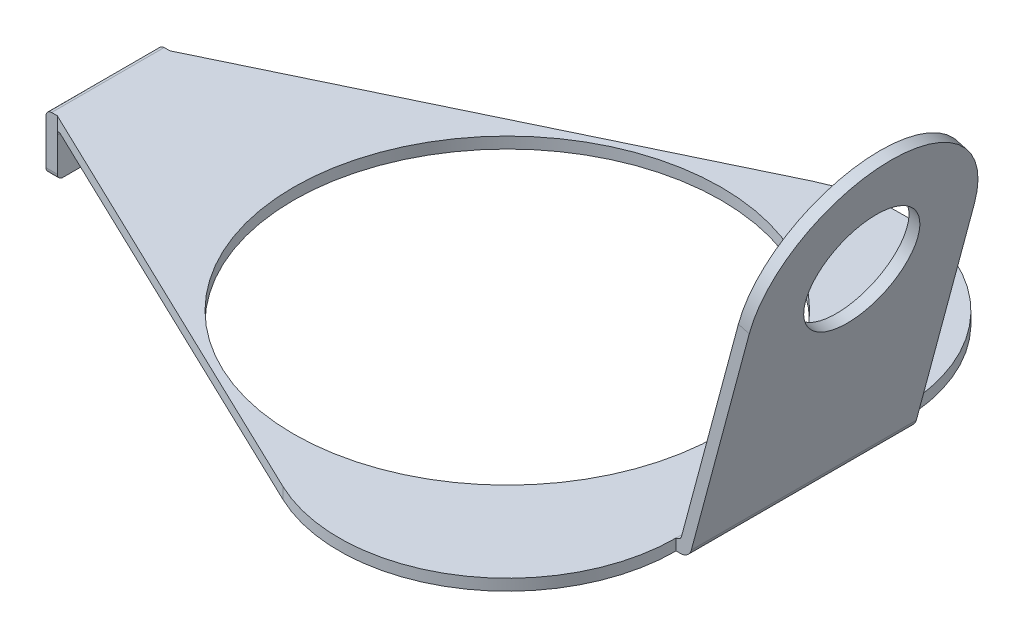
ISO-10303-21;
HEADER;
FILE_DESCRIPTION(('STEP AP214'),'2;1');
FILE_NAME('part.step','',(''),(''),'','','');
FILE_SCHEMA(('AUTOMOTIVE_DESIGN { 1 0 10303 214 1 1 1 1 }'));
ENDSEC;
DATA;
#1=APPLICATION_CONTEXT('core data for automotive mechanical design processes');
#2=APPLICATION_PROTOCOL_DEFINITION('international standard','automotive_design',2000,#1);
#3=PRODUCT_CONTEXT('',#1,'mechanical');
#4=PRODUCT('Part','Part','',(#3));
#5=PRODUCT_RELATED_PRODUCT_CATEGORY('part','',(#4));
#6=PRODUCT_DEFINITION_FORMATION('','',#4);
#7=PRODUCT_DEFINITION_CONTEXT('part definition',#1,'design');
#8=PRODUCT_DEFINITION('design','',#6,#7);
#9=PRODUCT_DEFINITION_SHAPE('','',#8);
#10=(LENGTH_UNIT() NAMED_UNIT(*) SI_UNIT(.MILLI.,.METRE.));
#11=(NAMED_UNIT(*) PLANE_ANGLE_UNIT() SI_UNIT($,.RADIAN.));
#12=(NAMED_UNIT(*) SI_UNIT($,.STERADIAN.) SOLID_ANGLE_UNIT());
#13=UNCERTAINTY_MEASURE_WITH_UNIT(LENGTH_MEASURE(1.E-05),#10,'distance_accuracy_value','');
#14=(GEOMETRIC_REPRESENTATION_CONTEXT(3) GLOBAL_UNCERTAINTY_ASSIGNED_CONTEXT((#13)) GLOBAL_UNIT_ASSIGNED_CONTEXT((#10,
#11,#12)) REPRESENTATION_CONTEXT('',''));
#15=CARTESIAN_POINT('',(0.,0.,0.));
#16=DIRECTION('',(0.,0.,1.));
#17=DIRECTION('',(1.,0.,0.));
#18=AXIS2_PLACEMENT_3D('',#15,#16,#17);
#19=CARTESIAN_POINT('',(8.65846886349737,7.52425212699832,-2.54));
#20=DIRECTION('',(0.965925826289067,-0.258819045102524,0.));
#21=DIRECTION('',(0.258819045102524,0.965925826289067,0.));
#22=AXIS2_PLACEMENT_3D('',#19,#20,#21);
#23=PLANE('',#22);
#24=CARTESIAN_POINT('',(8.00106848893696,5.07080052822409,0.));
#25=DIRECTION('',(0.965925826289067,-0.258819045102525,0.));
#26=DIRECTION('',(0.258819045102525,0.965925826289067,0.));
#27=AXIS2_PLACEMENT_3D('',#24,#25,#26);
#28=CIRCLE('',#27,2.54);
#29=CARTESIAN_POINT('',(8.00106848893697,5.07080052822409,2.54));
#30=VERTEX_POINT('',#29);
#31=CARTESIAN_POINT('',(8.00106848893696,5.07080052822409,-2.54));
#32=VERTEX_POINT('',#31);
#33=EDGE_CURVE('E196',#30,#32,#28,.F.);
#34=ORIENTED_EDGE('',*,*,#33,.F.);
#35=DIRECTION('',(0.258819045102525,0.965925826289067,0.));
#36=VECTOR('',#35,1.);
#37=CARTESIAN_POINT('',(6.69279568735075,0.188259962543961,2.54));
#38=LINE('',#37,#36);
#39=CARTESIAN_POINT('',(6.69279568735075,0.18825996254396,2.54));
#40=VERTEX_POINT('',#39);
#41=EDGE_CURVE('E171',#40,#30,#38,.T.);
#42=ORIENTED_EDGE('',*,*,#41,.F.);
#43=DIRECTION('',(0.,0.,1.));
#44=VECTOR('',#43,1.);
#45=CARTESIAN_POINT('',(6.69279568735075,0.188259962543961,-2.54));
#46=LINE('',#45,#44);
#47=CARTESIAN_POINT('',(6.69279568735075,0.18825996254396,-2.54));
#48=VERTEX_POINT('',#47);
#49=EDGE_CURVE('E202',#48,#40,#46,.T.);
#50=ORIENTED_EDGE('',*,*,#49,.F.);
#51=DIRECTION('',(0.258819045102525,0.965925826289067,0.));
#52=VECTOR('',#51,1.);
#53=CARTESIAN_POINT('',(6.69279568735075,0.188259962543961,-2.54));
#54=LINE('',#53,#52);
#55=EDGE_CURVE('E177',#48,#32,#54,.T.);
#56=ORIENTED_EDGE('',*,*,#55,.T.);
#57=EDGE_LOOP('',(#34,#42,#50,#56));
#58=FACE_BOUND('',#57,.T.);
#59=CARTESIAN_POINT('',(8.00106848893697,5.07080052822409,0.));
#60=DIRECTION('',(0.965925826289067,-0.258819045102525,0.));
#61=DIRECTION('',(0.258819045102525,0.965925826289067,0.));
#62=AXIS2_PLACEMENT_3D('',#59,#60,#61);
#63=CIRCLE('',#62,1.27);
#64=CARTESIAN_POINT('',(8.32976867621718,6.2975263276112,0.));
#65=VERTEX_POINT('',#64);
#66=EDGE_CURVE('E256',#65,#65,#63,.F.);
#67=ORIENTED_EDGE('',*,*,#66,.T.);
#68=EDGE_LOOP('',(#67));
#69=FACE_BOUND('',#68,.T.);
#70=ADVANCED_FACE('F25',(#58,#69),#23,.T.);
#71=CARTESIAN_POINT('',(-8.89,-1.016,0.));
#72=DIRECTION('',(-1.,0.,0.));
#73=DIRECTION('',(0.,0.,1.));
#74=AXIS2_PLACEMENT_3D('',#71,#72,#73);
#75=PLANE('',#74);
#76=CARTESIAN_POINT('',(-8.89,-0.889,-1.143));
#77=DIRECTION('',(1.,0.,0.));
#78=DIRECTION('',(0.,0.,-1.));
#79=AXIS2_PLACEMENT_3D('',#76,#77,#78);
#80=CIRCLE('',#79,0.127);
#81=CARTESIAN_POINT('',(-8.89,-0.889,-1.27));
#82=VERTEX_POINT('',#81);
#83=CARTESIAN_POINT('',(-8.89,-1.016,-1.143));
#84=VERTEX_POINT('',#83);
#85=EDGE_CURVE('E200',#82,#84,#80,.F.);
#86=ORIENTED_EDGE('',*,*,#85,.F.);
#87=DIRECTION('',(0.,1.,0.));
#88=VECTOR('',#87,1.);
#89=CARTESIAN_POINT('',(-8.89,-1.016,-1.27));
#90=LINE('',#89,#88);
#91=CARTESIAN_POINT('',(-8.89,-0.127,-1.27));
#92=VERTEX_POINT('',#91);
#93=EDGE_CURVE('E197',#92,#82,#90,.F.);
#94=ORIENTED_EDGE('',*,*,#93,.F.);
#95=DIRECTION('',(0.,0.,1.));
#96=VECTOR('',#95,1.);
#97=CARTESIAN_POINT('',(-8.89,-0.127,0.));
#98=LINE('',#97,#96);
#99=CARTESIAN_POINT('',(-8.89,-0.127,1.27));
#100=VERTEX_POINT('',#99);
#101=EDGE_CURVE('E247',#92,#100,#98,.T.);
#102=ORIENTED_EDGE('',*,*,#101,.T.);
#103=DIRECTION('',(0.,1.,0.));
#104=VECTOR('',#103,1.);
#105=CARTESIAN_POINT('',(-8.89,-1.016,1.27));
#106=LINE('',#105,#104);
#107=CARTESIAN_POINT('',(-8.89,-0.889,1.27));
#108=VERTEX_POINT('',#107);
#109=EDGE_CURVE('E142',#108,#100,#106,.T.);
#110=ORIENTED_EDGE('',*,*,#109,.F.);
#111=CARTESIAN_POINT('',(-8.89,-0.889,1.143));
#112=DIRECTION('',(-1.,0.,0.));
#113=DIRECTION('',(0.,0.,1.));
#114=AXIS2_PLACEMENT_3D('',#111,#112,#113);
#115=CIRCLE('',#114,0.127);
#116=CARTESIAN_POINT('',(-8.89,-1.016,1.143));
#117=VERTEX_POINT('',#116);
#118=EDGE_CURVE('E28',#117,#108,#115,.T.);
#119=ORIENTED_EDGE('',*,*,#118,.F.);
#120=DIRECTION('',(0.,0.,1.));
#121=VECTOR('',#120,1.);
#122=CARTESIAN_POINT('',(-8.89,-1.016,0.));
#123=LINE('',#122,#121);
#124=EDGE_CURVE('E140',#117,#84,#123,.F.);
#125=ORIENTED_EDGE('',*,*,#124,.T.);
#126=EDGE_LOOP('',(#86,#94,#102,#110,#119,#125));
#127=FACE_BOUND('',#126,.T.);
#128=ADVANCED_FACE('F139',(#127),#75,.F.);
#129=CARTESIAN_POINT('',(-8.6252960951108,9.52582149158518,0.));
#130=DIRECTION('',(0.965925826289067,-0.258819045102525,0.));
#131=DIRECTION('',(0.258819045102525,0.965925826289067,0.));
#132=AXIS2_PLACEMENT_3D('',#129,#130,#131);
#133=CYLINDRICAL_SURFACE('',#132,1.27);
#134=CARTESIAN_POINT('',(7.75572332905955,5.13654056568013,0.));
#135=DIRECTION('',(0.965925826289067,-0.258819045102525,0.));
#136=DIRECTION('',(0.258819045102525,0.965925826289067,0.));
#137=AXIS2_PLACEMENT_3D('',#134,#135,#136);
#138=CIRCLE('',#137,1.27);
#139=CARTESIAN_POINT('',(8.08442351633975,6.36326636506725,0.));
#140=VERTEX_POINT('',#139);
#141=EDGE_CURVE('E239',#140,#140,#138,.T.);
#142=ORIENTED_EDGE('',*,*,#141,.F.);
#143=EDGE_LOOP('',(#142));
#144=FACE_BOUND('',#143,.T.);
#145=ORIENTED_EDGE('',*,*,#66,.F.);
#146=EDGE_LOOP('',(#145));
#147=FACE_BOUND('',#146,.T.);
#148=ADVANCED_FACE('F558',(#144,#147),#133,.F.);
#149=CARTESIAN_POINT('',(-8.6252960951108,9.52582149158518,0.));
#150=DIRECTION('',(0.965925826289067,-0.258819045102525,0.));
#151=DIRECTION('',(0.258819045102525,0.965925826289067,0.));
#152=AXIS2_PLACEMENT_3D('',#149,#150,#151);
#153=CYLINDRICAL_SURFACE('',#152,2.54);
#154=ORIENTED_EDGE('',*,*,#33,.T.);
#155=DIRECTION('',(-0.965925826289068,0.258819045102523,0.));
#156=VECTOR('',#155,1.);
#157=CARTESIAN_POINT('',(8.00106848893696,5.07080052822409,-2.54));
#158=LINE('',#157,#156);
#159=CARTESIAN_POINT('',(7.75572332905954,5.13654056568013,-2.54));
#160=VERTEX_POINT('',#159);
#161=EDGE_CURVE('E193',#32,#160,#158,.T.);
#162=ORIENTED_EDGE('',*,*,#161,.T.);
#163=CARTESIAN_POINT('',(7.75572332905955,5.13654056568013,0.));
#164=DIRECTION('',(0.965925826289067,-0.258819045102525,0.));
#165=DIRECTION('',(0.258819045102525,0.965925826289067,0.));
#166=AXIS2_PLACEMENT_3D('',#163,#164,#165);
#167=CIRCLE('',#166,2.54);
#168=CARTESIAN_POINT('',(7.75572332905954,5.13654056568013,2.54));
#169=VERTEX_POINT('',#168);
#170=EDGE_CURVE('E237',#169,#160,#167,.F.);
#171=ORIENTED_EDGE('',*,*,#170,.F.);
#172=DIRECTION('',(-0.965925826289068,0.258819045102522,0.));
#173=VECTOR('',#172,1.);
#174=CARTESIAN_POINT('',(8.00106848893696,5.07080052822409,2.54));
#175=LINE('',#174,#173);
#176=EDGE_CURVE('E174',#30,#169,#175,.T.);
#177=ORIENTED_EDGE('',*,*,#176,.F.);
#178=EDGE_LOOP('',(#154,#162,#171,#177));
#179=FACE_BOUND('',#178,.T.);
#180=ADVANCED_FACE('F376',(#179),#153,.T.);
#181=CARTESIAN_POINT('',(6.35,0.381,-2.54));
#182=DIRECTION('',(0.,0.,1.));
#183=DIRECTION('',(1.,0.,0.));
#184=AXIS2_PLACEMENT_3D('',#181,#182,#183);
#185=PLANE('',#184);
#186=CARTESIAN_POINT('',(6.44745052747333,0.254,-2.54));
#187=DIRECTION('',(0.,0.,1.));
#188=DIRECTION('',(1.,0.,0.));
#189=AXIS2_PLACEMENT_3D('',#186,#187,#188);
#190=CIRCLE('',#189,0.254);
#191=CARTESIAN_POINT('',(6.44745052747333,0.,-2.54));
#192=VERTEX_POINT('',#191);
#193=EDGE_CURVE('E205',#192,#48,#190,.T.);
#194=ORIENTED_EDGE('',*,*,#193,.F.);
#195=DIRECTION('',(1.,0.,0.));
#196=VECTOR('',#195,1.);
#197=CARTESIAN_POINT('',(6.35,0.,-2.54));
#198=LINE('',#197,#196);
#199=CARTESIAN_POINT('',(6.35,0.,-2.54));
#200=VERTEX_POINT('',#199);
#201=EDGE_CURVE('E187',#200,#192,#198,.T.);
#202=ORIENTED_EDGE('',*,*,#201,.F.);
#203=DIRECTION('',(0.,1.,0.));
#204=VECTOR('',#203,1.);
#205=CARTESIAN_POINT('',(6.35,0.381,-2.54));
#206=LINE('',#205,#204);
#207=CARTESIAN_POINT('',(6.35,0.254,-2.54));
#208=VERTEX_POINT('',#207);
#209=EDGE_CURVE('E189',#208,#200,#206,.F.);
#210=ORIENTED_EDGE('',*,*,#209,.F.);
#211=CARTESIAN_POINT('',(6.35,0.381,-2.54));
#212=DIRECTION('',(0.,0.,1.));
#213=DIRECTION('',(1.,0.,0.));
#214=AXIS2_PLACEMENT_3D('',#211,#212,#213);
#215=CIRCLE('',#214,0.127);
#216=CARTESIAN_POINT('',(6.47267257993871,0.348129981271979,-2.54));
#217=VERTEX_POINT('',#216);
#218=EDGE_CURVE('E192',#217,#208,#215,.F.);
#219=ORIENTED_EDGE('',*,*,#218,.F.);
#220=DIRECTION('',(-0.258819045102524,-0.965925826289067,0.));
#221=VECTOR('',#220,1.);
#222=CARTESIAN_POINT('',(6.47267257993871,0.348129981271979,-2.54));
#223=LINE('',#222,#221);
#224=EDGE_CURVE('E164',#160,#217,#223,.T.);
#225=ORIENTED_EDGE('',*,*,#224,.F.);
#226=ORIENTED_EDGE('',*,*,#161,.F.);
#227=ORIENTED_EDGE('',*,*,#55,.F.);
#228=EDGE_LOOP('',(#194,#202,#210,#219,#225,#226,#227));
#229=FACE_BOUND('',#228,.T.);
#230=ADVANCED_FACE('F387',(#229),#185,.F.);
#231=CARTESIAN_POINT('',(6.35,0.381,2.54));
#232=DIRECTION('',(0.,0.,1.));
#233=DIRECTION('',(1.,0.,0.));
#234=AXIS2_PLACEMENT_3D('',#231,#232,#233);
#235=PLANE('',#234);
#236=CARTESIAN_POINT('',(6.35,0.381,2.54));
#237=DIRECTION('',(0.,0.,1.));
#238=DIRECTION('',(1.,0.,0.));
#239=AXIS2_PLACEMENT_3D('',#236,#237,#238);
#240=CIRCLE('',#239,0.127);
#241=CARTESIAN_POINT('',(6.47267257993871,0.348129981271979,2.54));
#242=VERTEX_POINT('',#241);
#243=CARTESIAN_POINT('',(6.35,0.254,2.54));
#244=VERTEX_POINT('',#243);
#245=EDGE_CURVE('E170',#242,#244,#240,.F.);
#246=ORIENTED_EDGE('',*,*,#245,.T.);
#247=DIRECTION('',(0.,1.,0.));
#248=VECTOR('',#247,1.);
#249=CARTESIAN_POINT('',(6.35,0.381,2.54));
#250=LINE('',#249,#248);
#251=CARTESIAN_POINT('',(6.35,0.,2.54));
#252=VERTEX_POINT('',#251);
#253=EDGE_CURVE('E154',#244,#252,#250,.F.);
#254=ORIENTED_EDGE('',*,*,#253,.T.);
#255=DIRECTION('',(1.,0.,0.));
#256=VECTOR('',#255,1.);
#257=CARTESIAN_POINT('',(6.35,0.,2.54));
#258=LINE('',#257,#256);
#259=CARTESIAN_POINT('',(6.44745052747333,0.,2.54));
#260=VERTEX_POINT('',#259);
#261=EDGE_CURVE('E175',#252,#260,#258,.T.);
#262=ORIENTED_EDGE('',*,*,#261,.T.);
#263=CARTESIAN_POINT('',(6.44745052747333,0.254,2.54));
#264=DIRECTION('',(0.,0.,1.));
#265=DIRECTION('',(1.,0.,0.));
#266=AXIS2_PLACEMENT_3D('',#263,#264,#265);
#267=CIRCLE('',#266,0.254);
#268=EDGE_CURVE('E204',#40,#260,#267,.F.);
#269=ORIENTED_EDGE('',*,*,#268,.F.);
#270=ORIENTED_EDGE('',*,*,#41,.T.);
#271=ORIENTED_EDGE('',*,*,#176,.T.);
#272=DIRECTION('',(-0.258819045102524,-0.965925826289067,0.));
#273=VECTOR('',#272,1.);
#274=CARTESIAN_POINT('',(6.47267257993871,0.348129981271979,2.54));
#275=LINE('',#274,#273);
#276=EDGE_CURVE('E159',#242,#169,#275,.F.);
#277=ORIENTED_EDGE('',*,*,#276,.F.);
#278=EDGE_LOOP('',(#246,#254,#262,#269,#270,#271,#277));
#279=FACE_BOUND('',#278,.T.);
#280=ADVANCED_FACE('F365',(#279),#235,.T.);
#281=CARTESIAN_POINT('',(0.,-1.016,0.));
#282=DIRECTION('',(0.,1.,0.));
#283=DIRECTION('',(0.,0.,1.));
#284=AXIS2_PLACEMENT_3D('',#281,#282,#283);
#285=PLANE('',#284);
#286=DIRECTION('',(1.,0.,0.));
#287=VECTOR('',#286,1.);
#288=CARTESIAN_POINT('',(0.,-1.016,-1.143));
#289=LINE('',#288,#287);
#290=CARTESIAN_POINT('',(-9.144,-1.016,-1.143));
#291=VERTEX_POINT('',#290);
#292=EDGE_CURVE('E153',#84,#291,#289,.F.);
#293=ORIENTED_EDGE('',*,*,#292,.F.);
#294=ORIENTED_EDGE('',*,*,#124,.F.);
#295=DIRECTION('',(-1.,0.,0.));
#296=VECTOR('',#295,1.);
#297=CARTESIAN_POINT('',(0.,-1.016,1.143));
#298=LINE('',#297,#296);
#299=CARTESIAN_POINT('',(-9.144,-1.016,1.143));
#300=VERTEX_POINT('',#299);
#301=EDGE_CURVE('E151',#300,#117,#298,.F.);
#302=ORIENTED_EDGE('',*,*,#301,.F.);
#303=DIRECTION('',(0.,0.,-1.));
#304=VECTOR('',#303,1.);
#305=CARTESIAN_POINT('',(-9.144,-1.016,0.));
#306=LINE('',#305,#304);
#307=EDGE_CURVE('E161',#300,#291,#306,.T.);
#308=ORIENTED_EDGE('',*,*,#307,.T.);
#309=EDGE_LOOP('',(#293,#294,#302,#308));
#310=FACE_BOUND('',#309,.T.);
#311=ADVANCED_FACE('F149',(#310),#285,.F.);
#312=CARTESIAN_POINT('',(6.44745052747333,0.254,-2.54));
#313=DIRECTION('',(0.,0.,1.));
#314=DIRECTION('',(1.,0.,0.));
#315=AXIS2_PLACEMENT_3D('',#312,#313,#314);
#316=CYLINDRICAL_SURFACE('',#315,0.254);
#317=ORIENTED_EDGE('',*,*,#268,.T.);
#318=DIRECTION('',(0.,0.,-1.));
#319=VECTOR('',#318,1.);
#320=CARTESIAN_POINT('',(6.44745052747333,0.,-2.54));
#321=LINE('',#320,#319);
#322=EDGE_CURVE('E206',#192,#260,#321,.F.);
#323=ORIENTED_EDGE('',*,*,#322,.F.);
#324=ORIENTED_EDGE('',*,*,#193,.T.);
#325=ORIENTED_EDGE('',*,*,#49,.T.);
#326=EDGE_LOOP('',(#317,#323,#324,#325));
#327=FACE_BOUND('',#326,.T.);
#328=ADVANCED_FACE('F367',(#327),#316,.T.);
#329=CARTESIAN_POINT('',(-8.763,-0.127,0.));
#330=DIRECTION('',(0.,0.,1.));
#331=DIRECTION('',(1.,0.,0.));
#332=AXIS2_PLACEMENT_3D('',#329,#330,#331);
#333=CYLINDRICAL_SURFACE('',#332,0.127);
#334=DIRECTION('',(0.,0.,-1.));
#335=VECTOR('',#334,1.);
#336=CARTESIAN_POINT('',(-8.763,0.,-2.54));
#337=LINE('',#336,#335);
#338=CARTESIAN_POINT('',(-8.763,0.,1.33095234475121));
#339=VERTEX_POINT('',#338);
#340=CARTESIAN_POINT('',(-8.763,0.,-1.33095234475121));
#341=VERTEX_POINT('',#340);
#342=EDGE_CURVE('E208',#339,#341,#337,.T.);
#343=ORIENTED_EDGE('',*,*,#342,.F.);
#344=CARTESIAN_POINT('',(-8.763,-0.127,1.33095234475121));
#345=DIRECTION('',(0.432686900226594,0.,-0.901544256469033));
#346=DIRECTION('',(0.901544256469033,0.,0.432686900226594));
#347=AXIS2_PLACEMENT_3D('',#344,#345,#346);
#348=ELLIPSE('',#347,0.140869401683513,0.127);
#349=EDGE_CURVE('E245',#100,#339,#348,.T.);
#350=ORIENTED_EDGE('',*,*,#349,.F.);
#351=ORIENTED_EDGE('',*,*,#101,.F.);
#352=CARTESIAN_POINT('',(-8.763,-0.127,-1.33095234475121));
#353=DIRECTION('',(0.432686900226594,0.,0.901544256469033));
#354=DIRECTION('',(-0.901544256469033,0.,0.432686900226594));
#355=AXIS2_PLACEMENT_3D('',#352,#353,#354);
#356=ELLIPSE('',#355,0.140869401683513,0.127);
#357=EDGE_CURVE('E242',#341,#92,#356,.T.);
#358=ORIENTED_EDGE('',*,*,#357,.F.);
#359=EDGE_LOOP('',(#343,#350,#351,#358));
#360=FACE_BOUND('',#359,.T.);
#361=ADVANCED_FACE('F267',(#360),#333,.F.);
#362=CARTESIAN_POINT('',(6.47267257993871,0.348129981271979,-2.54));
#363=DIRECTION('',(-0.965925826289067,0.258819045102524,0.));
#364=DIRECTION('',(-0.258819045102524,-0.965925826289067,0.));
#365=AXIS2_PLACEMENT_3D('',#362,#363,#364);
#366=PLANE('',#365);
#367=DIRECTION('',(0.,0.,1.));
#368=VECTOR('',#367,1.);
#369=CARTESIAN_POINT('',(6.47267257993871,0.34812998127198,-2.54));
#370=LINE('',#369,#368);
#371=EDGE_CURVE('E178',#217,#242,#370,.T.);
#372=ORIENTED_EDGE('',*,*,#371,.T.);
#373=ORIENTED_EDGE('',*,*,#276,.T.);
#374=ORIENTED_EDGE('',*,*,#170,.T.);
#375=ORIENTED_EDGE('',*,*,#224,.T.);
#376=EDGE_LOOP('',(#372,#373,#374,#375));
#377=FACE_BOUND('',#376,.T.);
#378=ORIENTED_EDGE('',*,*,#141,.T.);
#379=EDGE_LOOP('',(#378));
#380=FACE_BOUND('',#379,.T.);
#381=ADVANCED_FACE('F380',(#377,#380),#366,.T.);
#382=CARTESIAN_POINT('',(0.,-0.889,1.143));
#383=DIRECTION('',(-1.,0.,0.));
#384=DIRECTION('',(0.,0.,1.));
#385=AXIS2_PLACEMENT_3D('',#382,#383,#384);
#386=CYLINDRICAL_SURFACE('',#385,0.127);
#387=CARTESIAN_POINT('',(-9.144,-0.889,1.143));
#388=DIRECTION('',(-1.,0.,0.));
#389=DIRECTION('',(0.,0.,1.));
#390=AXIS2_PLACEMENT_3D('',#387,#388,#389);
#391=CIRCLE('',#390,0.127);
#392=CARTESIAN_POINT('',(-9.144,-0.889,1.27));
#393=VERTEX_POINT('',#392);
#394=EDGE_CURVE('E158',#393,#300,#391,.F.);
#395=ORIENTED_EDGE('',*,*,#394,.T.);
#396=ORIENTED_EDGE('',*,*,#301,.T.);
#397=ORIENTED_EDGE('',*,*,#118,.T.);
#398=DIRECTION('',(-1.,0.,0.));
#399=VECTOR('',#398,1.);
#400=CARTESIAN_POINT('',(0.,-0.889,1.27));
#401=LINE('',#400,#399);
#402=EDGE_CURVE('E294',#108,#393,#401,.T.);
#403=ORIENTED_EDGE('',*,*,#402,.T.);
#404=EDGE_LOOP('',(#395,#396,#397,#403));
#405=FACE_BOUND('',#404,.T.);
#406=ADVANCED_FACE('F157',(#405),#386,.T.);
#407=CARTESIAN_POINT('',(-9.144,-1.016,0.));
#408=DIRECTION('',(1.,0.,0.));
#409=DIRECTION('',(0.,0.,-1.));
#410=AXIS2_PLACEMENT_3D('',#407,#408,#409);
#411=PLANE('',#410);
#412=CARTESIAN_POINT('',(-9.144,-0.889,-1.143));
#413=DIRECTION('',(1.,0.,0.));
#414=DIRECTION('',(0.,0.,-1.));
#415=AXIS2_PLACEMENT_3D('',#412,#413,#414);
#416=CIRCLE('',#415,0.127);
#417=CARTESIAN_POINT('',(-9.144,-0.889,-1.27));
#418=VERTEX_POINT('',#417);
#419=EDGE_CURVE('E209',#291,#418,#416,.T.);
#420=ORIENTED_EDGE('',*,*,#419,.F.);
#421=ORIENTED_EDGE('',*,*,#307,.F.);
#422=ORIENTED_EDGE('',*,*,#394,.F.);
#423=DIRECTION('',(0.,1.,0.));
#424=VECTOR('',#423,1.);
#425=CARTESIAN_POINT('',(-9.144,-1.016,1.27));
#426=LINE('',#425,#424);
#427=CARTESIAN_POINT('',(-9.144,0.127,1.27));
#428=VERTEX_POINT('',#427);
#429=EDGE_CURVE('E228',#393,#428,#426,.T.);
#430=ORIENTED_EDGE('',*,*,#429,.T.);
#431=DIRECTION('',(0.,0.,-1.));
#432=VECTOR('',#431,1.);
#433=CARTESIAN_POINT('',(-9.144,0.127,0.));
#434=LINE('',#433,#432);
#435=CARTESIAN_POINT('',(-9.144,0.127,-1.27));
#436=VERTEX_POINT('',#435);
#437=EDGE_CURVE('E227',#436,#428,#434,.F.);
#438=ORIENTED_EDGE('',*,*,#437,.F.);
#439=DIRECTION('',(0.,1.,0.));
#440=VECTOR('',#439,1.);
#441=CARTESIAN_POINT('',(-9.144,-1.016,-1.27));
#442=LINE('',#441,#440);
#443=EDGE_CURVE('E235',#418,#436,#442,.T.);
#444=ORIENTED_EDGE('',*,*,#443,.F.);
#445=EDGE_LOOP('',(#420,#421,#422,#430,#438,#444));
#446=FACE_BOUND('',#445,.T.);
#447=ADVANCED_FACE('F301',(#446),#411,.F.);
#448=CARTESIAN_POINT('',(0.,-0.889,-1.143));
#449=DIRECTION('',(1.,0.,0.));
#450=DIRECTION('',(0.,0.,-1.));
#451=AXIS2_PLACEMENT_3D('',#448,#449,#450);
#452=CYLINDRICAL_SURFACE('',#451,0.127);
#453=ORIENTED_EDGE('',*,*,#419,.T.);
#454=DIRECTION('',(-1.,0.,0.));
#455=VECTOR('',#454,1.);
#456=CARTESIAN_POINT('',(0.,-0.889,-1.27));
#457=LINE('',#456,#455);
#458=EDGE_CURVE('E224',#82,#418,#457,.T.);
#459=ORIENTED_EDGE('',*,*,#458,.F.);
#460=ORIENTED_EDGE('',*,*,#85,.T.);
#461=ORIENTED_EDGE('',*,*,#292,.T.);
#462=EDGE_LOOP('',(#453,#459,#460,#461));
#463=FACE_BOUND('',#462,.T.);
#464=ADVANCED_FACE('F260',(#463),#452,.T.);
#465=CARTESIAN_POINT('',(2.54652615454516,0.,-2.54));
#466=DIRECTION('',(0.,-1.,0.));
#467=DIRECTION('',(0.,0.,-1.));
#468=AXIS2_PLACEMENT_3D('',#465,#466,#467);
#469=PLANE('',#468);
#470=CARTESIAN_POINT('',(0.,0.,0.));
#471=DIRECTION('',(0.,-1.,0.));
#472=DIRECTION('',(0.,0.,-1.));
#473=AXIS2_PLACEMENT_3D('',#470,#471,#472);
#474=CIRCLE('',#473,4.826);
#475=CARTESIAN_POINT('',(0.,0.,-4.826));
#476=VERTEX_POINT('',#475);
#477=EDGE_CURVE('E219',#476,#476,#474,.F.);
#478=ORIENTED_EDGE('',*,*,#477,.T.);
#479=EDGE_LOOP('',(#478));
#480=FACE_BOUND('',#479,.T.);
#481=DIRECTION('',(0.901544256469033,0.,-0.432686900226594));
#482=VECTOR('',#481,1.);
#483=CARTESIAN_POINT('',(-8.89,0.,-1.27));
#484=LINE('',#483,#482);
#485=CARTESIAN_POINT('',(0.900812846262377,0.,-5.969));
#486=VERTEX_POINT('',#485);
#487=EDGE_CURVE('E281',#341,#486,#484,.T.);
#488=ORIENTED_EDGE('',*,*,#487,.T.);
#489=CARTESIAN_POINT('',(2.54652615454516,0.,-2.54));
#490=DIRECTION('',(0.,-1.,0.));
#491=DIRECTION('',(0.,0.,-1.));
#492=AXIS2_PLACEMENT_3D('',#489,#490,#491);
#493=CIRCLE('',#492,3.80347384545484);
#494=EDGE_CURVE('E182',#200,#486,#493,.F.);
#495=ORIENTED_EDGE('',*,*,#494,.F.);
#496=ORIENTED_EDGE('',*,*,#201,.T.);
#497=ORIENTED_EDGE('',*,*,#322,.T.);
#498=ORIENTED_EDGE('',*,*,#261,.F.);
#499=CARTESIAN_POINT('',(2.54652615454516,0.,2.54));
#500=DIRECTION('',(0.,-1.,0.));
#501=DIRECTION('',(0.,0.,-1.));
#502=AXIS2_PLACEMENT_3D('',#499,#500,#501);
#503=CIRCLE('',#502,3.80347384545484);
#504=CARTESIAN_POINT('',(0.900812846262377,0.,5.969));
#505=VERTEX_POINT('',#504);
#506=EDGE_CURVE('E181',#505,#252,#503,.F.);
#507=ORIENTED_EDGE('',*,*,#506,.F.);
#508=DIRECTION('',(-0.901544256469033,0.,-0.432686900226594));
#509=VECTOR('',#508,1.);
#510=CARTESIAN_POINT('',(-8.89,0.,1.27));
#511=LINE('',#510,#509);
#512=EDGE_CURVE('E328',#505,#339,#511,.T.);
#513=ORIENTED_EDGE('',*,*,#512,.T.);
#514=ORIENTED_EDGE('',*,*,#342,.T.);
#515=EDGE_LOOP('',(#488,#495,#496,#497,#498,#507,#513,#514));
#516=FACE_BOUND('',#515,.T.);
#517=ADVANCED_FACE('F361',(#480,#516),#469,.T.);
#518=CARTESIAN_POINT('',(-8.89,0.254,-1.27));
#519=DIRECTION('',(0.432686900226594,0.,0.901544256469033));
#520=DIRECTION('',(0.901544256469033,0.,-0.432686900226594));
#521=AXIS2_PLACEMENT_3D('',#518,#519,#520);
#522=PLANE('',#521);
#523=ORIENTED_EDGE('',*,*,#357,.T.);
#524=DIRECTION('',(0.,1.,0.));
#525=VECTOR('',#524,1.);
#526=CARTESIAN_POINT('',(-8.89,-1.016,-1.27));
#527=LINE('',#526,#525);
#528=CARTESIAN_POINT('',(-8.89,0.254,-1.27));
#529=VERTEX_POINT('',#528);
#530=EDGE_CURVE('E222',#529,#92,#527,.F.);
#531=ORIENTED_EDGE('',*,*,#530,.F.);
#532=DIRECTION('',(0.901544256469033,0.,-0.432686900226594));
#533=VECTOR('',#532,1.);
#534=CARTESIAN_POINT('',(-8.89,0.254,-1.27));
#535=LINE('',#534,#533);
#536=CARTESIAN_POINT('',(0.900812846262376,0.254,-5.969));
#537=VERTEX_POINT('',#536);
#538=EDGE_CURVE('E218',#529,#537,#535,.T.);
#539=ORIENTED_EDGE('',*,*,#538,.T.);
#540=DIRECTION('',(0.,-1.,0.));
#541=VECTOR('',#540,1.);
#542=CARTESIAN_POINT('',(0.900812846262377,0.254,-5.969));
#543=LINE('',#542,#541);
#544=EDGE_CURVE('E233',#486,#537,#543,.F.);
#545=ORIENTED_EDGE('',*,*,#544,.F.);
#546=ORIENTED_EDGE('',*,*,#487,.F.);
#547=EDGE_LOOP('',(#523,#531,#539,#545,#546));
#548=FACE_BOUND('',#547,.T.);
#549=ADVANCED_FACE('F278',(#548),#522,.F.);
#550=CARTESIAN_POINT('',(2.54652615454516,0.254,-2.54));
#551=DIRECTION('',(0.,-1.,0.));
#552=DIRECTION('',(0.,0.,-1.));
#553=AXIS2_PLACEMENT_3D('',#550,#551,#552);
#554=CYLINDRICAL_SURFACE('',#553,3.80347384545484);
#555=ORIENTED_EDGE('',*,*,#209,.T.);
#556=ORIENTED_EDGE('',*,*,#494,.T.);
#557=ORIENTED_EDGE('',*,*,#544,.T.);
#558=CARTESIAN_POINT('',(2.54652615454516,0.254,-2.54));
#559=DIRECTION('',(0.,-1.,0.));
#560=DIRECTION('',(0.,0.,-1.));
#561=AXIS2_PLACEMENT_3D('',#558,#559,#560);
#562=CIRCLE('',#561,3.80347384545484);
#563=EDGE_CURVE('E216',#537,#208,#562,.T.);
#564=ORIENTED_EDGE('',*,*,#563,.T.);
#565=EDGE_LOOP('',(#555,#556,#557,#564));
#566=FACE_BOUND('',#565,.T.);
#567=ADVANCED_FACE('F389',(#566),#554,.T.);
#568=CARTESIAN_POINT('',(6.35,0.381,-2.54));
#569=DIRECTION('',(0.,0.,1.));
#570=DIRECTION('',(1.,0.,0.));
#571=AXIS2_PLACEMENT_3D('',#568,#569,#570);
#572=CYLINDRICAL_SURFACE('',#571,0.127);
#573=ORIENTED_EDGE('',*,*,#245,.F.);
#574=ORIENTED_EDGE('',*,*,#371,.F.);
#575=ORIENTED_EDGE('',*,*,#218,.T.);
#576=DIRECTION('',(0.,0.,-1.));
#577=VECTOR('',#576,1.);
#578=CARTESIAN_POINT('',(6.35,0.254,-2.54));
#579=LINE('',#578,#577);
#580=EDGE_CURVE('E215',#208,#244,#579,.F.);
#581=ORIENTED_EDGE('',*,*,#580,.T.);
#582=EDGE_LOOP('',(#573,#574,#575,#581));
#583=FACE_BOUND('',#582,.T.);
#584=ADVANCED_FACE('F384',(#583),#572,.F.);
#585=CARTESIAN_POINT('',(2.54652615454516,0.254,2.54));
#586=DIRECTION('',(0.,-1.,0.));
#587=DIRECTION('',(0.,0.,-1.));
#588=AXIS2_PLACEMENT_3D('',#585,#586,#587);
#589=CYLINDRICAL_SURFACE('',#588,3.80347384545484);
#590=CARTESIAN_POINT('',(2.54652615454516,0.254,2.54));
#591=DIRECTION('',(0.,-1.,0.));
#592=DIRECTION('',(0.,0.,-1.));
#593=AXIS2_PLACEMENT_3D('',#590,#591,#592);
#594=CIRCLE('',#593,3.80347384545484);
#595=CARTESIAN_POINT('',(0.900812846262377,0.254,5.969));
#596=VERTEX_POINT('',#595);
#597=EDGE_CURVE('E211',#244,#596,#594,.T.);
#598=ORIENTED_EDGE('',*,*,#597,.T.);
#599=DIRECTION('',(0.,1.,0.));
#600=VECTOR('',#599,1.);
#601=CARTESIAN_POINT('',(0.900812846262377,0.254,5.969));
#602=LINE('',#601,#600);
#603=EDGE_CURVE('E231',#596,#505,#602,.F.);
#604=ORIENTED_EDGE('',*,*,#603,.T.);
#605=ORIENTED_EDGE('',*,*,#506,.T.);
#606=ORIENTED_EDGE('',*,*,#253,.F.);
#607=EDGE_LOOP('',(#598,#604,#605,#606));
#608=FACE_BOUND('',#607,.T.);
#609=ADVANCED_FACE('F335',(#608),#589,.T.);
#610=CARTESIAN_POINT('',(-8.89,0.254,1.27));
#611=DIRECTION('',(0.432686900226594,0.,-0.901544256469033));
#612=DIRECTION('',(-0.901544256469033,0.,-0.432686900226594));
#613=AXIS2_PLACEMENT_3D('',#610,#611,#612);
#614=PLANE('',#613);
#615=ORIENTED_EDGE('',*,*,#349,.T.);
#616=ORIENTED_EDGE('',*,*,#512,.F.);
#617=ORIENTED_EDGE('',*,*,#603,.F.);
#618=DIRECTION('',(-0.901544256469033,0.,-0.432686900226594));
#619=VECTOR('',#618,1.);
#620=CARTESIAN_POINT('',(0.900812846262376,0.254,5.969));
#621=LINE('',#620,#619);
#622=CARTESIAN_POINT('',(-8.89,0.254,1.27));
#623=VERTEX_POINT('',#622);
#624=EDGE_CURVE('E214',#596,#623,#621,.T.);
#625=ORIENTED_EDGE('',*,*,#624,.T.);
#626=DIRECTION('',(0.,1.,0.));
#627=VECTOR('',#626,1.);
#628=CARTESIAN_POINT('',(-8.89,-1.016,1.27));
#629=LINE('',#628,#627);
#630=EDGE_CURVE('E295',#623,#100,#629,.F.);
#631=ORIENTED_EDGE('',*,*,#630,.T.);
#632=EDGE_LOOP('',(#615,#616,#617,#625,#631));
#633=FACE_BOUND('',#632,.T.);
#634=ADVANCED_FACE('F344',(#633),#614,.F.);
#635=CARTESIAN_POINT('',(0.,-1.016,1.27));
#636=DIRECTION('',(0.,0.,-1.));
#637=DIRECTION('',(-1.,0.,0.));
#638=AXIS2_PLACEMENT_3D('',#635,#636,#637);
#639=PLANE('',#638);
#640=ORIENTED_EDGE('',*,*,#402,.F.);
#641=ORIENTED_EDGE('',*,*,#109,.T.);
#642=ORIENTED_EDGE('',*,*,#630,.F.);
#643=DIRECTION('',(1.,0.,0.));
#644=VECTOR('',#643,1.);
#645=CARTESIAN_POINT('',(2.54652615454516,0.254,1.27));
#646=LINE('',#645,#644);
#647=CARTESIAN_POINT('',(-9.017,0.254,1.27));
#648=VERTEX_POINT('',#647);
#649=EDGE_CURVE('E312',#623,#648,#646,.F.);
#650=ORIENTED_EDGE('',*,*,#649,.T.);
#651=CARTESIAN_POINT('',(-9.017,0.127,1.27));
#652=DIRECTION('',(0.,0.,-1.));
#653=DIRECTION('',(-1.,0.,0.));
#654=AXIS2_PLACEMENT_3D('',#651,#652,#653);
#655=CIRCLE('',#654,0.127);
#656=EDGE_CURVE('E225',#428,#648,#655,.T.);
#657=ORIENTED_EDGE('',*,*,#656,.F.);
#658=ORIENTED_EDGE('',*,*,#429,.F.);
#659=EDGE_LOOP('',(#640,#641,#642,#650,#657,#658));
#660=FACE_BOUND('',#659,.T.);
#661=ADVANCED_FACE('F360',(#660),#639,.F.);
#662=CARTESIAN_POINT('',(-9.017,0.127,0.));
#663=DIRECTION('',(0.,0.,-1.));
#664=DIRECTION('',(-1.,0.,0.));
#665=AXIS2_PLACEMENT_3D('',#662,#663,#664);
#666=CYLINDRICAL_SURFACE('',#665,0.127);
#667=CARTESIAN_POINT('',(-9.017,0.127,-1.27));
#668=DIRECTION('',(0.,0.,-1.));
#669=DIRECTION('',(-1.,0.,0.));
#670=AXIS2_PLACEMENT_3D('',#667,#668,#669);
#671=CIRCLE('',#670,0.127);
#672=CARTESIAN_POINT('',(-9.017,0.254,-1.27));
#673=VERTEX_POINT('',#672);
#674=EDGE_CURVE('E43',#436,#673,#671,.T.);
#675=ORIENTED_EDGE('',*,*,#674,.F.);
#676=ORIENTED_EDGE('',*,*,#437,.T.);
#677=ORIENTED_EDGE('',*,*,#656,.T.);
#678=DIRECTION('',(0.,0.,-1.));
#679=VECTOR('',#678,1.);
#680=CARTESIAN_POINT('',(-9.017,0.254,-2.54));
#681=LINE('',#680,#679);
#682=EDGE_CURVE('E308',#648,#673,#681,.T.);
#683=ORIENTED_EDGE('',*,*,#682,.T.);
#684=EDGE_LOOP('',(#675,#676,#677,#683));
#685=FACE_BOUND('',#684,.T.);
#686=ADVANCED_FACE('F306',(#685),#666,.T.);
#687=CARTESIAN_POINT('',(0.,-1.016,-1.27));
#688=DIRECTION('',(0.,0.,-1.));
#689=DIRECTION('',(-1.,0.,0.));
#690=AXIS2_PLACEMENT_3D('',#687,#688,#689);
#691=PLANE('',#690);
#692=DIRECTION('',(1.,0.,0.));
#693=VECTOR('',#692,1.);
#694=CARTESIAN_POINT('',(2.54652615454516,0.254,-1.27));
#695=LINE('',#694,#693);
#696=EDGE_CURVE('E34',#673,#529,#695,.T.);
#697=ORIENTED_EDGE('',*,*,#696,.T.);
#698=ORIENTED_EDGE('',*,*,#530,.T.);
#699=ORIENTED_EDGE('',*,*,#93,.T.);
#700=ORIENTED_EDGE('',*,*,#458,.T.);
#701=ORIENTED_EDGE('',*,*,#443,.T.);
#702=ORIENTED_EDGE('',*,*,#674,.T.);
#703=EDGE_LOOP('',(#697,#698,#699,#700,#701,#702));
#704=FACE_BOUND('',#703,.T.);
#705=ADVANCED_FACE('F272',(#704),#691,.T.);
#706=CARTESIAN_POINT('',(0.,0.254,0.));
#707=DIRECTION('',(0.,-1.,0.));
#708=DIRECTION('',(0.,0.,-1.));
#709=AXIS2_PLACEMENT_3D('',#706,#707,#708);
#710=CYLINDRICAL_SURFACE('',#709,4.826);
#711=ORIENTED_EDGE('',*,*,#477,.F.);
#712=EDGE_LOOP('',(#711));
#713=FACE_BOUND('',#712,.T.);
#714=CARTESIAN_POINT('',(0.,0.254,0.));
#715=DIRECTION('',(0.,-1.,0.));
#716=DIRECTION('',(0.,0.,-1.));
#717=AXIS2_PLACEMENT_3D('',#714,#715,#716);
#718=CIRCLE('',#717,4.826);
#719=CARTESIAN_POINT('',(0.,0.254,-4.826));
#720=VERTEX_POINT('',#719);
#721=EDGE_CURVE('E13',#720,#720,#718,.F.);
#722=ORIENTED_EDGE('',*,*,#721,.T.);
#723=EDGE_LOOP('',(#722));
#724=FACE_BOUND('',#723,.T.);
#725=ADVANCED_FACE('F400',(#713,#724),#710,.F.);
#726=CARTESIAN_POINT('',(2.54652615454516,0.254,-2.54));
#727=DIRECTION('',(0.,-1.,0.));
#728=DIRECTION('',(0.,0.,-1.));
#729=AXIS2_PLACEMENT_3D('',#726,#727,#728);
#730=PLANE('',#729);
#731=ORIENTED_EDGE('',*,*,#721,.F.);
#732=EDGE_LOOP('',(#731));
#733=FACE_BOUND('',#732,.T.);
#734=ORIENTED_EDGE('',*,*,#682,.F.);
#735=ORIENTED_EDGE('',*,*,#649,.F.);
#736=ORIENTED_EDGE('',*,*,#624,.F.);
#737=ORIENTED_EDGE('',*,*,#597,.F.);
#738=ORIENTED_EDGE('',*,*,#580,.F.);
#739=ORIENTED_EDGE('',*,*,#563,.F.);
#740=ORIENTED_EDGE('',*,*,#538,.F.);
#741=ORIENTED_EDGE('',*,*,#696,.F.);
#742=EDGE_LOOP('',(#734,#735,#736,#737,#738,#739,#740,#741));
#743=FACE_BOUND('',#742,.T.);
#744=ADVANCED_FACE('F347',(#733,#743),#730,.F.);
#745=CLOSED_SHELL('',(#70,#128,#148,#180,#230,#280,#311,#328,#361,#381,#406,#447,#464,#517,#549,
#567,#584,#609,#634,#661,#686,#705,#725,#744));
#746=MANIFOLD_SOLID_BREP('B1',#745);
#747=ADVANCED_BREP_SHAPE_REPRESENTATION('',(#18,#746),#14);
#748=SHAPE_DEFINITION_REPRESENTATION(#9,#747);
ENDSEC;
END-ISO-10303-21;
